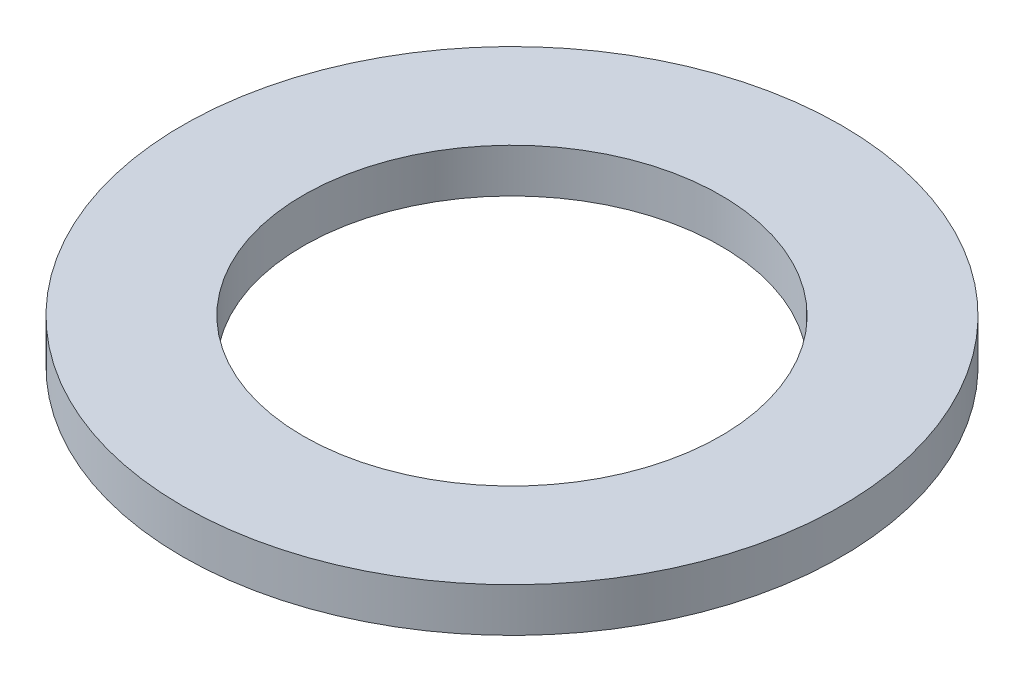
ISO-10303-21;
HEADER;
FILE_DESCRIPTION(('STEP AP214'),'2;1');
FILE_NAME('part.step','',(''),(''),'','','');
FILE_SCHEMA(('AUTOMOTIVE_DESIGN { 1 0 10303 214 1 1 1 1 }'));
ENDSEC;
DATA;
#1=APPLICATION_CONTEXT('core data for automotive mechanical design processes');
#2=APPLICATION_PROTOCOL_DEFINITION('international standard','automotive_design',2000,#1);
#3=PRODUCT_CONTEXT('',#1,'mechanical');
#4=PRODUCT('Part','Part','',(#3));
#5=PRODUCT_RELATED_PRODUCT_CATEGORY('part','',(#4));
#6=PRODUCT_DEFINITION_FORMATION('','',#4);
#7=PRODUCT_DEFINITION_CONTEXT('part definition',#1,'design');
#8=PRODUCT_DEFINITION('design','',#6,#7);
#9=PRODUCT_DEFINITION_SHAPE('','',#8);
#10=(LENGTH_UNIT() NAMED_UNIT(*) SI_UNIT(.MILLI.,.METRE.));
#11=(NAMED_UNIT(*) PLANE_ANGLE_UNIT() SI_UNIT($,.RADIAN.));
#12=(NAMED_UNIT(*) SI_UNIT($,.STERADIAN.) SOLID_ANGLE_UNIT());
#13=UNCERTAINTY_MEASURE_WITH_UNIT(LENGTH_MEASURE(1.E-05),#10,'distance_accuracy_value','');
#14=(GEOMETRIC_REPRESENTATION_CONTEXT(3) GLOBAL_UNCERTAINTY_ASSIGNED_CONTEXT((#13)) GLOBAL_UNIT_ASSIGNED_CONTEXT((#10,
#11,#12)) REPRESENTATION_CONTEXT('',''));
#15=CARTESIAN_POINT('',(0.,0.,0.));
#16=DIRECTION('',(0.,0.,1.));
#17=DIRECTION('',(1.,0.,0.));
#18=AXIS2_PLACEMENT_3D('',#15,#16,#17);
#19=CARTESIAN_POINT('',(0.,10.,0.));
#20=DIRECTION('',(0.,-1.,0.));
#21=DIRECTION('',(0.,0.,-1.));
#22=AXIS2_PLACEMENT_3D('',#19,#20,#21);
#23=CYLINDRICAL_SURFACE('',#22,75.);
#24=CARTESIAN_POINT('',(0.,10.,0.));
#25=DIRECTION('',(0.,1.,0.));
#26=DIRECTION('',(0.,0.,1.));
#27=AXIS2_PLACEMENT_3D('',#24,#25,#26);
#28=CIRCLE('',#27,75.);
#29=CARTESIAN_POINT('',(0.,10.,75.));
#30=VERTEX_POINT('',#29);
#31=EDGE_CURVE('E10',#30,#30,#28,.T.);
#32=ORIENTED_EDGE('',*,*,#31,.F.);
#33=EDGE_LOOP('',(#32));
#34=FACE_BOUND('',#33,.T.);
#35=CARTESIAN_POINT('',(0.,0.,0.));
#36=DIRECTION('',(0.,1.,0.));
#37=DIRECTION('',(0.,0.,1.));
#38=AXIS2_PLACEMENT_3D('',#35,#36,#37);
#39=CIRCLE('',#38,75.);
#40=CARTESIAN_POINT('',(0.,0.,75.));
#41=VERTEX_POINT('',#40);
#42=EDGE_CURVE('E37',#41,#41,#39,.T.);
#43=ORIENTED_EDGE('',*,*,#42,.T.);
#44=EDGE_LOOP('',(#43));
#45=FACE_BOUND('',#44,.T.);
#46=ADVANCED_FACE('F40',(#34,#45),#23,.T.);
#47=CARTESIAN_POINT('',(0.,10.,0.));
#48=DIRECTION('',(0.,1.,0.));
#49=DIRECTION('',(0.,0.,1.));
#50=AXIS2_PLACEMENT_3D('',#47,#48,#49);
#51=PLANE('',#50);
#52=CARTESIAN_POINT('',(0.,10.,0.));
#53=DIRECTION('',(0.,1.,0.));
#54=DIRECTION('',(0.,0.,1.));
#55=AXIS2_PLACEMENT_3D('',#52,#53,#54);
#56=CIRCLE('',#55,47.5);
#57=CARTESIAN_POINT('',(0.,10.,47.5));
#58=VERTEX_POINT('',#57);
#59=EDGE_CURVE('E50',#58,#58,#56,.T.);
#60=ORIENTED_EDGE('',*,*,#59,.F.);
#61=EDGE_LOOP('',(#60));
#62=FACE_BOUND('',#61,.T.);
#63=ORIENTED_EDGE('',*,*,#31,.T.);
#64=EDGE_LOOP('',(#63));
#65=FACE_BOUND('',#64,.T.);
#66=ADVANCED_FACE('F59',(#62,#65),#51,.T.);
#67=CARTESIAN_POINT('',(0.,0.,0.));
#68=DIRECTION('',(0.,1.,0.));
#69=DIRECTION('',(0.,0.,1.));
#70=AXIS2_PLACEMENT_3D('',#67,#68,#69);
#71=PLANE('',#70);
#72=CARTESIAN_POINT('',(0.,0.,0.));
#73=DIRECTION('',(0.,1.,0.));
#74=DIRECTION('',(0.,0.,1.));
#75=AXIS2_PLACEMENT_3D('',#72,#73,#74);
#76=CIRCLE('',#75,47.5);
#77=CARTESIAN_POINT('',(0.,0.,47.5));
#78=VERTEX_POINT('',#77);
#79=EDGE_CURVE('E47',#78,#78,#76,.T.);
#80=ORIENTED_EDGE('',*,*,#79,.T.);
#81=EDGE_LOOP('',(#80));
#82=FACE_BOUND('',#81,.T.);
#83=ORIENTED_EDGE('',*,*,#42,.F.);
#84=EDGE_LOOP('',(#83));
#85=FACE_BOUND('',#84,.T.);
#86=ADVANCED_FACE('F58',(#82,#85),#71,.F.);
#87=CARTESIAN_POINT('',(0.,10.,0.));
#88=DIRECTION('',(0.,-1.,0.));
#89=DIRECTION('',(0.,0.,-1.));
#90=AXIS2_PLACEMENT_3D('',#87,#88,#89);
#91=CYLINDRICAL_SURFACE('',#90,47.5);
#92=ORIENTED_EDGE('',*,*,#59,.T.);
#93=EDGE_LOOP('',(#92));
#94=FACE_BOUND('',#93,.T.);
#95=ORIENTED_EDGE('',*,*,#79,.F.);
#96=EDGE_LOOP('',(#95));
#97=FACE_BOUND('',#96,.T.);
#98=ADVANCED_FACE('F54',(#94,#97),#91,.F.);
#99=CLOSED_SHELL('',(#46,#66,#86,#98));
#100=MANIFOLD_SOLID_BREP('B2',#99);
#101=ADVANCED_BREP_SHAPE_REPRESENTATION('',(#18,#100),#14);
#102=SHAPE_DEFINITION_REPRESENTATION(#9,#101);
ENDSEC;
END-ISO-10303-21;
